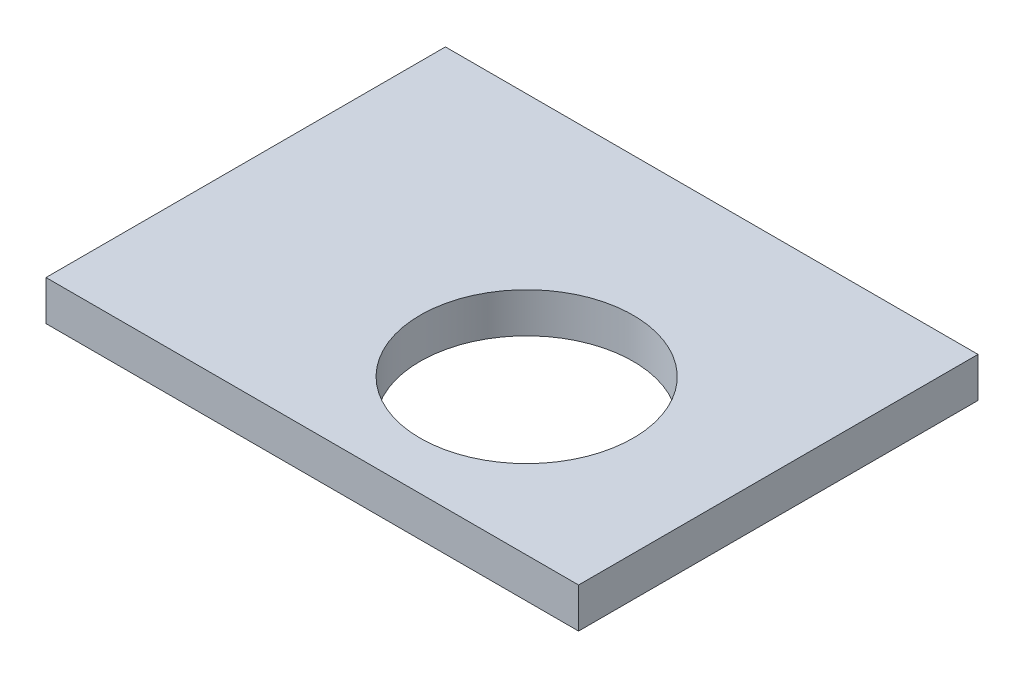
ISO-10303-21;
HEADER;
FILE_DESCRIPTION(('STEP AP214'),'2;1');
FILE_NAME('part.step','',(''),(''),'','','');
FILE_SCHEMA(('AUTOMOTIVE_DESIGN { 1 0 10303 214 1 1 1 1 }'));
ENDSEC;
DATA;
#1=APPLICATION_CONTEXT('core data for automotive mechanical design processes');
#2=APPLICATION_PROTOCOL_DEFINITION('international standard','automotive_design',2000,#1);
#3=PRODUCT_CONTEXT('',#1,'mechanical');
#4=PRODUCT('Part','Part','',(#3));
#5=PRODUCT_RELATED_PRODUCT_CATEGORY('part','',(#4));
#6=PRODUCT_DEFINITION_FORMATION('','',#4);
#7=PRODUCT_DEFINITION_CONTEXT('part definition',#1,'design');
#8=PRODUCT_DEFINITION('design','',#6,#7);
#9=PRODUCT_DEFINITION_SHAPE('','',#8);
#10=(LENGTH_UNIT() NAMED_UNIT(*) SI_UNIT(.MILLI.,.METRE.));
#11=(NAMED_UNIT(*) PLANE_ANGLE_UNIT() SI_UNIT($,.RADIAN.));
#12=(NAMED_UNIT(*) SI_UNIT($,.STERADIAN.) SOLID_ANGLE_UNIT());
#13=UNCERTAINTY_MEASURE_WITH_UNIT(LENGTH_MEASURE(1.E-05),#10,'distance_accuracy_value','');
#14=(GEOMETRIC_REPRESENTATION_CONTEXT(3) GLOBAL_UNCERTAINTY_ASSIGNED_CONTEXT((#13)) GLOBAL_UNIT_ASSIGNED_CONTEXT((#10,
#11,#12)) REPRESENTATION_CONTEXT('',''));
#15=CARTESIAN_POINT('',(0.,0.,0.));
#16=DIRECTION('',(0.,0.,1.));
#17=DIRECTION('',(1.,0.,0.));
#18=AXIS2_PLACEMENT_3D('',#15,#16,#17);
#19=CARTESIAN_POINT('',(0.,6.,0.));
#20=DIRECTION('',(0.,-1.,0.));
#21=DIRECTION('',(0.,0.,-1.));
#22=AXIS2_PLACEMENT_3D('',#19,#20,#21);
#23=PLANE('',#22);
#24=DIRECTION('',(0.,0.,1.));
#25=VECTOR('',#24,1.);
#26=CARTESIAN_POINT('',(0.,6.,0.));
#27=LINE('',#26,#25);
#28=CARTESIAN_POINT('',(0.,6.,-60.));
#29=VERTEX_POINT('',#28);
#30=CARTESIAN_POINT('',(0.,6.,0.));
#31=VERTEX_POINT('',#30);
#32=EDGE_CURVE('E86',#29,#31,#27,.T.);
#33=ORIENTED_EDGE('',*,*,#32,.T.);
#34=DIRECTION('',(1.,0.,0.));
#35=VECTOR('',#34,1.);
#36=CARTESIAN_POINT('',(0.,6.,0.));
#37=LINE('',#36,#35);
#38=CARTESIAN_POINT('',(80.,6.,0.));
#39=VERTEX_POINT('',#38);
#40=EDGE_CURVE('E81',#31,#39,#37,.T.);
#41=ORIENTED_EDGE('',*,*,#40,.T.);
#42=DIRECTION('',(0.,0.,-1.));
#43=VECTOR('',#42,1.);
#44=CARTESIAN_POINT('',(80.,6.,0.));
#45=LINE('',#44,#43);
#46=CARTESIAN_POINT('',(80.,6.,-60.));
#47=VERTEX_POINT('',#46);
#48=EDGE_CURVE('E84',#39,#47,#45,.T.);
#49=ORIENTED_EDGE('',*,*,#48,.T.);
#50=DIRECTION('',(-1.,0.,0.));
#51=VECTOR('',#50,1.);
#52=CARTESIAN_POINT('',(0.,6.,-60.));
#53=LINE('',#52,#51);
#54=EDGE_CURVE('E51',#47,#29,#53,.T.);
#55=ORIENTED_EDGE('',*,*,#54,.T.);
#56=EDGE_LOOP('',(#33,#41,#49,#55));
#57=FACE_BOUND('',#56,.T.);
#58=CARTESIAN_POINT('',(49.,6.,-23.2));
#59=DIRECTION('',(0.,1.,0.));
#60=DIRECTION('',(0.,0.,1.));
#61=AXIS2_PLACEMENT_3D('',#58,#59,#60);
#62=CIRCLE('',#61,16.);
#63=CARTESIAN_POINT('',(49.,6.,-7.2));
#64=VERTEX_POINT('',#63);
#65=EDGE_CURVE('E101',#64,#64,#62,.T.);
#66=ORIENTED_EDGE('',*,*,#65,.F.);
#67=EDGE_LOOP('',(#66));
#68=FACE_BOUND('',#67,.T.);
#69=ADVANCED_FACE('F34',(#57,#68),#23,.F.);
#70=CARTESIAN_POINT('',(0.,0.,0.));
#71=DIRECTION('',(0.,-1.,0.));
#72=DIRECTION('',(0.,0.,-1.));
#73=AXIS2_PLACEMENT_3D('',#70,#71,#72);
#74=PLANE('',#73);
#75=DIRECTION('',(0.,0.,1.));
#76=VECTOR('',#75,1.);
#77=CARTESIAN_POINT('',(0.,0.,0.));
#78=LINE('',#77,#76);
#79=CARTESIAN_POINT('',(0.,0.,-60.));
#80=VERTEX_POINT('',#79);
#81=CARTESIAN_POINT('',(0.,0.,0.));
#82=VERTEX_POINT('',#81);
#83=EDGE_CURVE('E98',#80,#82,#78,.T.);
#84=ORIENTED_EDGE('',*,*,#83,.F.);
#85=DIRECTION('',(-1.,0.,0.));
#86=VECTOR('',#85,1.);
#87=CARTESIAN_POINT('',(0.,0.,-60.));
#88=LINE('',#87,#86);
#89=CARTESIAN_POINT('',(80.,0.,-60.));
#90=VERTEX_POINT('',#89);
#91=EDGE_CURVE('E74',#90,#80,#88,.T.);
#92=ORIENTED_EDGE('',*,*,#91,.F.);
#93=DIRECTION('',(0.,0.,-1.));
#94=VECTOR('',#93,1.);
#95=CARTESIAN_POINT('',(80.,0.,0.));
#96=LINE('',#95,#94);
#97=CARTESIAN_POINT('',(80.,0.,0.));
#98=VERTEX_POINT('',#97);
#99=EDGE_CURVE('E68',#98,#90,#96,.T.);
#100=ORIENTED_EDGE('',*,*,#99,.F.);
#101=DIRECTION('',(1.,0.,0.));
#102=VECTOR('',#101,1.);
#103=CARTESIAN_POINT('',(0.,0.,0.));
#104=LINE('',#103,#102);
#105=EDGE_CURVE('E90',#82,#98,#104,.T.);
#106=ORIENTED_EDGE('',*,*,#105,.F.);
#107=EDGE_LOOP('',(#84,#92,#100,#106));
#108=FACE_BOUND('',#107,.T.);
#109=CARTESIAN_POINT('',(49.,0.,-23.2));
#110=DIRECTION('',(0.,1.,0.));
#111=DIRECTION('',(0.,0.,1.));
#112=AXIS2_PLACEMENT_3D('',#109,#110,#111);
#113=CIRCLE('',#112,16.);
#114=CARTESIAN_POINT('',(49.,0.,-7.2));
#115=VERTEX_POINT('',#114);
#116=EDGE_CURVE('E113',#115,#115,#113,.T.);
#117=ORIENTED_EDGE('',*,*,#116,.T.);
#118=EDGE_LOOP('',(#117));
#119=FACE_BOUND('',#118,.T.);
#120=ADVANCED_FACE('F109',(#108,#119),#74,.T.);
#121=CARTESIAN_POINT('',(0.,6.,0.));
#122=DIRECTION('',(1.,0.,0.));
#123=DIRECTION('',(0.,0.,-1.));
#124=AXIS2_PLACEMENT_3D('',#121,#122,#123);
#125=PLANE('',#124);
#126=ORIENTED_EDGE('',*,*,#83,.T.);
#127=DIRECTION('',(0.,-1.,0.));
#128=VECTOR('',#127,1.);
#129=CARTESIAN_POINT('',(0.,6.,0.));
#130=LINE('',#129,#128);
#131=EDGE_CURVE('E11',#31,#82,#130,.T.);
#132=ORIENTED_EDGE('',*,*,#131,.F.);
#133=ORIENTED_EDGE('',*,*,#32,.F.);
#134=DIRECTION('',(0.,-1.,0.));
#135=VECTOR('',#134,1.);
#136=CARTESIAN_POINT('',(0.,6.,-60.));
#137=LINE('',#136,#135);
#138=EDGE_CURVE('E94',#29,#80,#137,.T.);
#139=ORIENTED_EDGE('',*,*,#138,.T.);
#140=EDGE_LOOP('',(#126,#132,#133,#139));
#141=FACE_BOUND('',#140,.T.);
#142=ADVANCED_FACE('F36',(#141),#125,.F.);
#143=CARTESIAN_POINT('',(0.,6.,0.));
#144=DIRECTION('',(0.,0.,-1.));
#145=DIRECTION('',(-1.,0.,0.));
#146=AXIS2_PLACEMENT_3D('',#143,#144,#145);
#147=PLANE('',#146);
#148=ORIENTED_EDGE('',*,*,#105,.T.);
#149=DIRECTION('',(0.,-1.,0.));
#150=VECTOR('',#149,1.);
#151=CARTESIAN_POINT('',(80.,6.,0.));
#152=LINE('',#151,#150);
#153=EDGE_CURVE('E43',#39,#98,#152,.T.);
#154=ORIENTED_EDGE('',*,*,#153,.F.);
#155=ORIENTED_EDGE('',*,*,#40,.F.);
#156=ORIENTED_EDGE('',*,*,#131,.T.);
#157=EDGE_LOOP('',(#148,#154,#155,#156));
#158=FACE_BOUND('',#157,.T.);
#159=ADVANCED_FACE('F89',(#158),#147,.F.);
#160=CARTESIAN_POINT('',(80.,6.,0.));
#161=DIRECTION('',(-1.,0.,0.));
#162=DIRECTION('',(0.,0.,1.));
#163=AXIS2_PLACEMENT_3D('',#160,#161,#162);
#164=PLANE('',#163);
#165=ORIENTED_EDGE('',*,*,#99,.T.);
#166=DIRECTION('',(0.,-1.,0.));
#167=VECTOR('',#166,1.);
#168=CARTESIAN_POINT('',(80.,6.,-60.));
#169=LINE('',#168,#167);
#170=EDGE_CURVE('E91',#47,#90,#169,.T.);
#171=ORIENTED_EDGE('',*,*,#170,.F.);
#172=ORIENTED_EDGE('',*,*,#48,.F.);
#173=ORIENTED_EDGE('',*,*,#153,.T.);
#174=EDGE_LOOP('',(#165,#171,#172,#173));
#175=FACE_BOUND('',#174,.T.);
#176=ADVANCED_FACE('F92',(#175),#164,.F.);
#177=CARTESIAN_POINT('',(0.,6.,-60.));
#178=DIRECTION('',(0.,0.,1.));
#179=DIRECTION('',(1.,0.,0.));
#180=AXIS2_PLACEMENT_3D('',#177,#178,#179);
#181=PLANE('',#180);
#182=ORIENTED_EDGE('',*,*,#91,.T.);
#183=ORIENTED_EDGE('',*,*,#138,.F.);
#184=ORIENTED_EDGE('',*,*,#54,.F.);
#185=ORIENTED_EDGE('',*,*,#170,.T.);
#186=EDGE_LOOP('',(#182,#183,#184,#185));
#187=FACE_BOUND('',#186,.T.);
#188=ADVANCED_FACE('F106',(#187),#181,.F.);
#189=CARTESIAN_POINT('',(49.,6.,-23.2));
#190=DIRECTION('',(0.,-1.,0.));
#191=DIRECTION('',(0.,0.,-1.));
#192=AXIS2_PLACEMENT_3D('',#189,#190,#191);
#193=CYLINDRICAL_SURFACE('',#192,16.);
#194=ORIENTED_EDGE('',*,*,#65,.T.);
#195=EDGE_LOOP('',(#194));
#196=FACE_BOUND('',#195,.T.);
#197=ORIENTED_EDGE('',*,*,#116,.F.);
#198=EDGE_LOOP('',(#197));
#199=FACE_BOUND('',#198,.T.);
#200=ADVANCED_FACE('F119',(#196,#199),#193,.F.);
#201=CLOSED_SHELL('',(#69,#120,#142,#159,#176,#188,#200));
#202=MANIFOLD_SOLID_BREP('B2',#201);
#203=ADVANCED_BREP_SHAPE_REPRESENTATION('',(#18,#202),#14);
#204=SHAPE_DEFINITION_REPRESENTATION(#9,#203);
ENDSEC;
END-ISO-10303-21;
